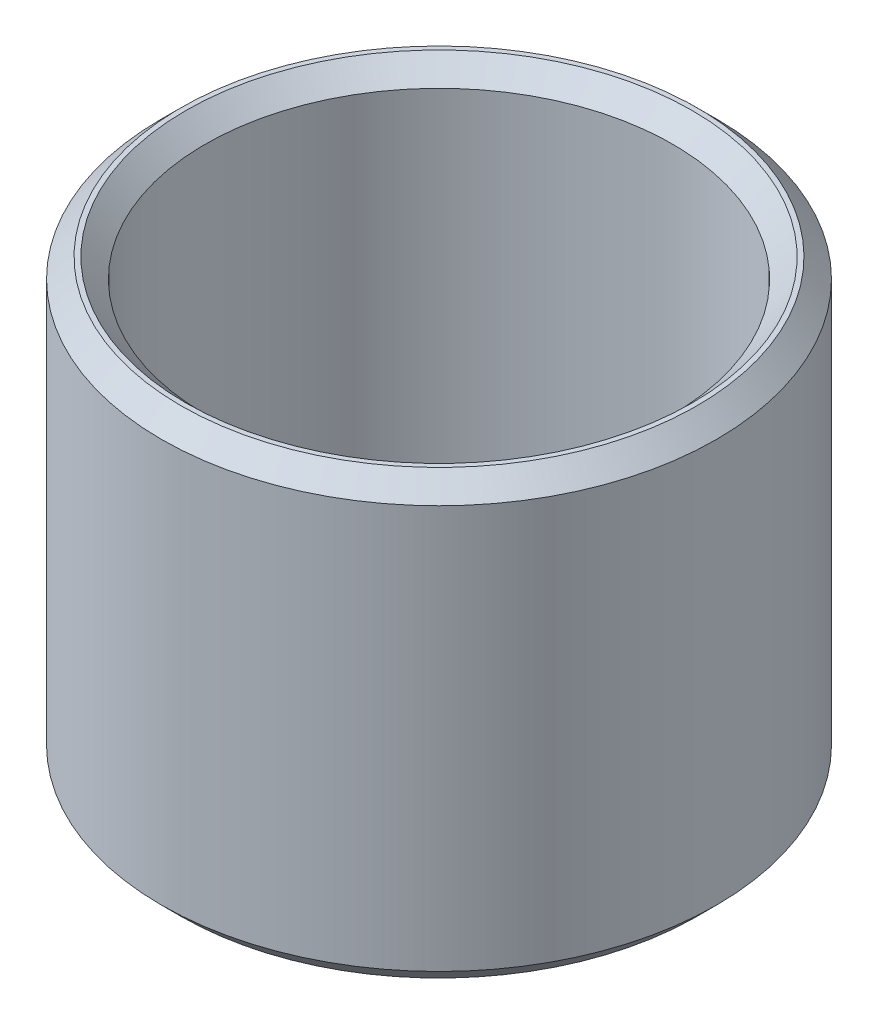
ISO-10303-21;
HEADER;
FILE_DESCRIPTION(('STEP AP214'),'2;1');
FILE_NAME('part.step','',(''),(''),'','','');
FILE_SCHEMA(('AUTOMOTIVE_DESIGN { 1 0 10303 214 1 1 1 1 }'));
ENDSEC;
DATA;
#1=APPLICATION_CONTEXT('core data for automotive mechanical design processes');
#2=APPLICATION_PROTOCOL_DEFINITION('international standard','automotive_design',2000,#1);
#3=PRODUCT_CONTEXT('',#1,'mechanical');
#4=PRODUCT('Part','Part','',(#3));
#5=PRODUCT_RELATED_PRODUCT_CATEGORY('part','',(#4));
#6=PRODUCT_DEFINITION_FORMATION('','',#4);
#7=PRODUCT_DEFINITION_CONTEXT('part definition',#1,'design');
#8=PRODUCT_DEFINITION('design','',#6,#7);
#9=PRODUCT_DEFINITION_SHAPE('','',#8);
#10=(LENGTH_UNIT() NAMED_UNIT(*) SI_UNIT(.MILLI.,.METRE.));
#11=(NAMED_UNIT(*) PLANE_ANGLE_UNIT() SI_UNIT($,.RADIAN.));
#12=(NAMED_UNIT(*) SI_UNIT($,.STERADIAN.) SOLID_ANGLE_UNIT());
#13=UNCERTAINTY_MEASURE_WITH_UNIT(LENGTH_MEASURE(1.E-05),#10,'distance_accuracy_value','');
#14=(GEOMETRIC_REPRESENTATION_CONTEXT(3) GLOBAL_UNCERTAINTY_ASSIGNED_CONTEXT((#13)) GLOBAL_UNIT_ASSIGNED_CONTEXT((#10,
#11,#12)) REPRESENTATION_CONTEXT('',''));
#15=CARTESIAN_POINT('',(0.,0.,0.));
#16=DIRECTION('',(0.,0.,1.));
#17=DIRECTION('',(1.,0.,0.));
#18=AXIS2_PLACEMENT_3D('',#15,#16,#17);
#19=CARTESIAN_POINT('',(0.,79.6697084755335,0.));
#20=DIRECTION('',(0.,-1.,0.));
#21=DIRECTION('',(0.,0.,-1.));
#22=AXIS2_PLACEMENT_3D('',#19,#20,#21);
#23=CYLINDRICAL_SURFACE('',#22,50.);
#24=CARTESIAN_POINT('',(0.,3.50286180210248,0.));
#25=DIRECTION('',(0.,1.,0.));
#26=DIRECTION('',(0.,0.,1.));
#27=AXIS2_PLACEMENT_3D('',#24,#25,#26);
#28=CIRCLE('',#27,50.);
#29=CARTESIAN_POINT('',(0.,3.50286180210248,50.));
#30=VERTEX_POINT('',#29);
#31=EDGE_CURVE('E10',#30,#30,#28,.T.);
#32=ORIENTED_EDGE('',*,*,#31,.T.);
#33=EDGE_LOOP('',(#32));
#34=FACE_BOUND('',#33,.T.);
#35=CARTESIAN_POINT('',(0.,76.1668466734309,0.));
#36=DIRECTION('',(0.,1.,0.));
#37=DIRECTION('',(0.,0.,1.));
#38=AXIS2_PLACEMENT_3D('',#35,#36,#37);
#39=CIRCLE('',#38,50.);
#40=CARTESIAN_POINT('',(0.,76.1668466734309,50.));
#41=VERTEX_POINT('',#40);
#42=EDGE_CURVE('E50',#41,#41,#39,.F.);
#43=ORIENTED_EDGE('',*,*,#42,.T.);
#44=EDGE_LOOP('',(#43));
#45=FACE_BOUND('',#44,.T.);
#46=ADVANCED_FACE('F39',(#34,#45),#23,.T.);
#47=CARTESIAN_POINT('',(0.,79.6697084755335,0.));
#48=DIRECTION('',(0.,1.,0.));
#49=DIRECTION('',(0.,0.,1.));
#50=AXIS2_PLACEMENT_3D('',#47,#48,#49);
#51=PLANE('',#50);
#52=CARTESIAN_POINT('',(0.,79.6697084755335,0.));
#53=DIRECTION('',(0.,1.,0.));
#54=DIRECTION('',(0.,0.,1.));
#55=AXIS2_PLACEMENT_3D('',#52,#53,#54);
#56=CIRCLE('',#55,45.621595786902);
#57=CARTESIAN_POINT('',(0.,79.6697084755335,45.621595786902));
#58=VERTEX_POINT('',#57);
#59=EDGE_CURVE('E58',#58,#58,#56,.F.);
#60=ORIENTED_EDGE('',*,*,#59,.T.);
#61=EDGE_LOOP('',(#60));
#62=FACE_BOUND('',#61,.T.);
#63=CARTESIAN_POINT('',(0.,79.6697084755335,0.));
#64=DIRECTION('',(0.,1.,0.));
#65=DIRECTION('',(0.,0.,1.));
#66=AXIS2_PLACEMENT_3D('',#63,#64,#65);
#67=CIRCLE('',#66,46.4971381978975);
#68=CARTESIAN_POINT('',(0.,79.6697084755335,46.4971381978975));
#69=VERTEX_POINT('',#68);
#70=EDGE_CURVE('E61',#69,#69,#67,.T.);
#71=ORIENTED_EDGE('',*,*,#70,.T.);
#72=EDGE_LOOP('',(#71));
#73=FACE_BOUND('',#72,.T.);
#74=ADVANCED_FACE('F88',(#62,#73),#51,.T.);
#75=CARTESIAN_POINT('',(0.,0.,0.));
#76=DIRECTION('',(0.,1.,0.));
#77=DIRECTION('',(0.,0.,1.));
#78=AXIS2_PLACEMENT_3D('',#75,#76,#77);
#79=PLANE('',#78);
#80=CARTESIAN_POINT('',(0.,0.,0.));
#81=DIRECTION('',(0.,1.,0.));
#82=DIRECTION('',(0.,0.,1.));
#83=AXIS2_PLACEMENT_3D('',#80,#81,#82);
#84=CIRCLE('',#83,45.621595786902);
#85=CARTESIAN_POINT('',(0.,0.,45.621595786902));
#86=VERTEX_POINT('',#85);
#87=EDGE_CURVE('E51',#86,#86,#84,.T.);
#88=ORIENTED_EDGE('',*,*,#87,.T.);
#89=EDGE_LOOP('',(#88));
#90=FACE_BOUND('',#89,.T.);
#91=CARTESIAN_POINT('',(0.,0.,0.));
#92=DIRECTION('',(0.,1.,0.));
#93=DIRECTION('',(0.,0.,1.));
#94=AXIS2_PLACEMENT_3D('',#91,#92,#93);
#95=CIRCLE('',#94,46.4971381978975);
#96=CARTESIAN_POINT('',(0.,0.,46.4971381978975));
#97=VERTEX_POINT('',#96);
#98=EDGE_CURVE('E54',#97,#97,#95,.F.);
#99=ORIENTED_EDGE('',*,*,#98,.T.);
#100=EDGE_LOOP('',(#99));
#101=FACE_BOUND('',#100,.T.);
#102=ADVANCED_FACE('F83',(#90,#101),#79,.F.);
#103=CARTESIAN_POINT('',(0.,79.6697084755335,0.));
#104=DIRECTION('',(0.,-1.,0.));
#105=DIRECTION('',(0.,0.,-1.));
#106=AXIS2_PLACEMENT_3D('',#103,#104,#105);
#107=CYLINDRICAL_SURFACE('',#106,42.1187339847995);
#108=CARTESIAN_POINT('',(0.,76.166846673431,0.));
#109=DIRECTION('',(0.,1.,0.));
#110=DIRECTION('',(0.,0.,1.));
#111=AXIS2_PLACEMENT_3D('',#108,#109,#110);
#112=CIRCLE('',#111,42.1187339847995);
#113=CARTESIAN_POINT('',(0.,76.166846673431,42.1187339847995));
#114=VERTEX_POINT('',#113);
#115=EDGE_CURVE('E67',#114,#114,#112,.T.);
#116=ORIENTED_EDGE('',*,*,#115,.T.);
#117=EDGE_LOOP('',(#116));
#118=FACE_BOUND('',#117,.T.);
#119=CARTESIAN_POINT('',(0.,3.50286180210251,0.));
#120=DIRECTION('',(0.,1.,0.));
#121=DIRECTION('',(0.,0.,1.));
#122=AXIS2_PLACEMENT_3D('',#119,#120,#121);
#123=CIRCLE('',#122,42.1187339847995);
#124=CARTESIAN_POINT('',(0.,3.50286180210251,42.1187339847995));
#125=VERTEX_POINT('',#124);
#126=EDGE_CURVE('E69',#125,#125,#123,.F.);
#127=ORIENTED_EDGE('',*,*,#126,.T.);
#128=EDGE_LOOP('',(#127));
#129=FACE_BOUND('',#128,.T.);
#130=ADVANCED_FACE('F71',(#118,#129),#107,.F.);
#131=CARTESIAN_POINT('',(0.,76.166846673431,0.));
#132=DIRECTION('',(0.,1.,0.));
#133=DIRECTION('',(0.,0.,1.));
#134=AXIS2_PLACEMENT_3D('',#131,#132,#133);
#135=CONICAL_SURFACE('',#134,42.1187339847995,0.785398163397451);
#136=ORIENTED_EDGE('',*,*,#59,.F.);
#137=EDGE_LOOP('',(#136));
#138=FACE_BOUND('',#137,.T.);
#139=ORIENTED_EDGE('',*,*,#115,.F.);
#140=EDGE_LOOP('',(#139));
#141=FACE_BOUND('',#140,.T.);
#142=ADVANCED_FACE('F77',(#138,#141),#135,.F.);
#143=CARTESIAN_POINT('',(0.,0.,0.));
#144=DIRECTION('',(0.,-1.,0.));
#145=DIRECTION('',(0.,0.,-1.));
#146=AXIS2_PLACEMENT_3D('',#143,#144,#145);
#147=CONICAL_SURFACE('',#146,45.621595786902,0.785398163397445);
#148=ORIENTED_EDGE('',*,*,#126,.F.);
#149=EDGE_LOOP('',(#148));
#150=FACE_BOUND('',#149,.T.);
#151=ORIENTED_EDGE('',*,*,#87,.F.);
#152=EDGE_LOOP('',(#151));
#153=FACE_BOUND('',#152,.T.);
#154=ADVANCED_FACE('F73',(#150,#153),#147,.F.);
#155=CARTESIAN_POINT('',(0.,3.50286180210248,0.));
#156=DIRECTION('',(0.,1.,0.));
#157=DIRECTION('',(0.,0.,1.));
#158=AXIS2_PLACEMENT_3D('',#155,#156,#157);
#159=CONICAL_SURFACE('',#158,50.,0.785398163397451);
#160=ORIENTED_EDGE('',*,*,#98,.F.);
#161=EDGE_LOOP('',(#160));
#162=FACE_BOUND('',#161,.T.);
#163=ORIENTED_EDGE('',*,*,#31,.F.);
#164=EDGE_LOOP('',(#163));
#165=FACE_BOUND('',#164,.T.);
#166=ADVANCED_FACE('F76',(#162,#165),#159,.T.);
#167=CARTESIAN_POINT('',(0.,79.6697084755335,0.));
#168=DIRECTION('',(0.,-1.,0.));
#169=DIRECTION('',(0.,0.,-1.));
#170=AXIS2_PLACEMENT_3D('',#167,#168,#169);
#171=CONICAL_SURFACE('',#170,46.4971381978975,0.785398163397446);
#172=ORIENTED_EDGE('',*,*,#42,.F.);
#173=EDGE_LOOP('',(#172));
#174=FACE_BOUND('',#173,.T.);
#175=ORIENTED_EDGE('',*,*,#70,.F.);
#176=EDGE_LOOP('',(#175));
#177=FACE_BOUND('',#176,.T.);
#178=ADVANCED_FACE('F45',(#174,#177),#171,.T.);
#179=CLOSED_SHELL('',(#46,#74,#102,#130,#142,#154,#166,#178));
#180=MANIFOLD_SOLID_BREP('B2',#179);
#181=ADVANCED_BREP_SHAPE_REPRESENTATION('',(#18,#180),#14);
#182=SHAPE_DEFINITION_REPRESENTATION(#9,#181);
ENDSEC;
END-ISO-10303-21;
